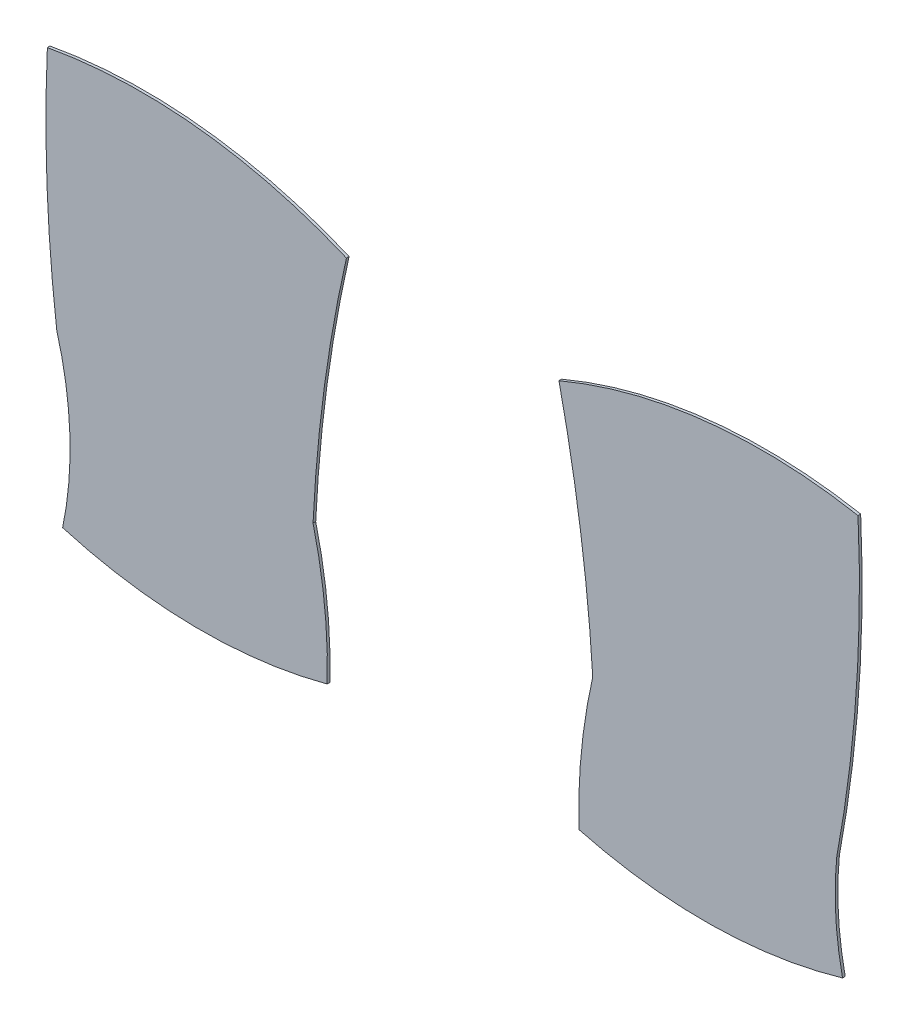
ISO-10303-21;
HEADER;
FILE_DESCRIPTION(('STEP AP214'),'2;1');
FILE_NAME('part.step','',(''),(''),'','','');
FILE_SCHEMA(('AUTOMOTIVE_DESIGN { 1 0 10303 214 1 1 1 1 }'));
ENDSEC;
DATA;
#1=APPLICATION_CONTEXT('core data for automotive mechanical design processes');
#2=APPLICATION_PROTOCOL_DEFINITION('international standard','automotive_design',2000,#1);
#3=PRODUCT_CONTEXT('',#1,'mechanical');
#4=PRODUCT('Part','Part','',(#3));
#5=PRODUCT_RELATED_PRODUCT_CATEGORY('part','',(#4));
#6=PRODUCT_DEFINITION_FORMATION('','',#4);
#7=PRODUCT_DEFINITION_CONTEXT('part definition',#1,'design');
#8=PRODUCT_DEFINITION('design','',#6,#7);
#9=PRODUCT_DEFINITION_SHAPE('','',#8);
#10=(LENGTH_UNIT() NAMED_UNIT(*) SI_UNIT(.MILLI.,.METRE.));
#11=(NAMED_UNIT(*) PLANE_ANGLE_UNIT() SI_UNIT($,.RADIAN.));
#12=(NAMED_UNIT(*) SI_UNIT($,.STERADIAN.) SOLID_ANGLE_UNIT());
#13=UNCERTAINTY_MEASURE_WITH_UNIT(LENGTH_MEASURE(1.E-05),#10,'distance_accuracy_value','');
#14=(GEOMETRIC_REPRESENTATION_CONTEXT(3) GLOBAL_UNCERTAINTY_ASSIGNED_CONTEXT((#13)) GLOBAL_UNIT_ASSIGNED_CONTEXT((#10,
#11,#12)) REPRESENTATION_CONTEXT('',''));
#15=CARTESIAN_POINT('',(0.,0.,0.));
#16=DIRECTION('',(0.,0.,1.));
#17=DIRECTION('',(1.,0.,0.));
#18=AXIS2_PLACEMENT_3D('',#15,#16,#17);
#19=CARTESIAN_POINT('',(80.1713590618614,25.8182537201133,0.1));
#20=DIRECTION('',(0.,0.,-1.));
#21=DIRECTION('',(-1.,0.,0.));
#22=AXIS2_PLACEMENT_3D('',#19,#20,#21);
#23=CYLINDRICAL_SURFACE('',#22,21.4266312052672);
#24=CARTESIAN_POINT('',(80.1713590618614,25.8182537201133,0.));
#25=DIRECTION('',(0.,0.,1.));
#26=DIRECTION('',(1.,0.,0.));
#27=AXIS2_PLACEMENT_3D('',#24,#25,#26);
#28=CIRCLE('',#27,21.4266312052672);
#29=CARTESIAN_POINT('',(59.2772554817541,30.5655645789343,0.));
#30=VERTEX_POINT('',#29);
#31=CARTESIAN_POINT('',(58.7503501447257,25.3274362606368,0.));
#32=VERTEX_POINT('',#31);
#33=EDGE_CURVE('E127',#30,#32,#28,.T.);
#34=ORIENTED_EDGE('',*,*,#33,.T.);
#35=DIRECTION('',(0.,0.,-1.));
#36=VECTOR('',#35,1.);
#37=CARTESIAN_POINT('',(58.7503501447257,25.3274362606368,0.1));
#38=LINE('',#37,#36);
#39=CARTESIAN_POINT('',(58.7503501447257,25.3274362606368,0.1));
#40=VERTEX_POINT('',#39);
#41=EDGE_CURVE('E12',#40,#32,#38,.T.);
#42=ORIENTED_EDGE('',*,*,#41,.F.);
#43=CARTESIAN_POINT('',(80.1713590618614,25.8182537201133,0.1));
#44=DIRECTION('',(0.,0.,1.));
#45=DIRECTION('',(1.,0.,0.));
#46=AXIS2_PLACEMENT_3D('',#43,#44,#45);
#47=CIRCLE('',#46,21.4266312052672);
#48=CARTESIAN_POINT('',(59.2772554817541,30.5655645789343,0.1));
#49=VERTEX_POINT('',#48);
#50=EDGE_CURVE('E137',#49,#40,#47,.T.);
#51=ORIENTED_EDGE('',*,*,#50,.F.);
#52=DIRECTION('',(0.,0.,-1.));
#53=VECTOR('',#52,1.);
#54=CARTESIAN_POINT('',(59.2772554817541,30.5655645789343,0.1));
#55=LINE('',#54,#53);
#56=EDGE_CURVE('E123',#49,#30,#55,.T.);
#57=ORIENTED_EDGE('',*,*,#56,.T.);
#58=EDGE_LOOP('',(#34,#42,#51,#57));
#59=FACE_BOUND('',#58,.T.);
#60=ADVANCED_FACE('F43',(#59),#23,.T.);
#61=CARTESIAN_POINT('',(63.5005492048398,43.2071904225175,0.1));
#62=DIRECTION('',(0.,0.,-1.));
#63=DIRECTION('',(-1.,0.,0.));
#64=AXIS2_PLACEMENT_3D('',#61,#62,#63);
#65=CYLINDRICAL_SURFACE('',#64,18.5);
#66=CARTESIAN_POINT('',(63.5005492048398,43.2071904225175,0.));
#67=DIRECTION('',(0.,0.,1.));
#68=DIRECTION('',(1.,0.,0.));
#69=AXIS2_PLACEMENT_3D('',#66,#67,#68);
#70=CIRCLE('',#69,18.5);
#71=CARTESIAN_POINT('',(68.6905961832509,25.4501238753119,0.));
#72=VERTEX_POINT('',#71);
#73=EDGE_CURVE('E130',#32,#72,#70,.T.);
#74=ORIENTED_EDGE('',*,*,#73,.T.);
#75=DIRECTION('',(0.,0.,-1.));
#76=VECTOR('',#75,1.);
#77=CARTESIAN_POINT('',(68.6905961832509,25.4501238753119,0.1));
#78=LINE('',#77,#76);
#79=CARTESIAN_POINT('',(68.6905961832509,25.4501238753119,0.1));
#80=VERTEX_POINT('',#79);
#81=EDGE_CURVE('E51',#80,#72,#78,.T.);
#82=ORIENTED_EDGE('',*,*,#81,.F.);
#83=CARTESIAN_POINT('',(63.5005492048398,43.2071904225175,0.1));
#84=DIRECTION('',(0.,0.,1.));
#85=DIRECTION('',(1.,0.,0.));
#86=AXIS2_PLACEMENT_3D('',#83,#84,#85);
#87=CIRCLE('',#86,18.5);
#88=EDGE_CURVE('E96',#40,#80,#87,.T.);
#89=ORIENTED_EDGE('',*,*,#88,.F.);
#90=ORIENTED_EDGE('',*,*,#41,.T.);
#91=EDGE_LOOP('',(#74,#82,#89,#90));
#92=FACE_BOUND('',#91,.T.);
#93=ADVANCED_FACE('F161',(#92),#65,.T.);
#94=CARTESIAN_POINT('',(80.8681917023297,28.075242465547,0.1));
#95=DIRECTION('',(0.,0.,-1.));
#96=DIRECTION('',(-1.,0.,0.));
#97=AXIS2_PLACEMENT_3D('',#94,#95,#96);
#98=CYLINDRICAL_SURFACE('',#97,12.4573303817104);
#99=CARTESIAN_POINT('',(80.8681917023297,28.075242465547,0.));
#100=DIRECTION('',(0.,0.,-1.));
#101=DIRECTION('',(1.,0.,0.));
#102=AXIS2_PLACEMENT_3D('',#99,#100,#101);
#103=CIRCLE('',#102,12.4573303817104);
#104=CARTESIAN_POINT('',(68.4699379891613,29.2870118755388,0.));
#105=VERTEX_POINT('',#104);
#106=EDGE_CURVE('E132',#72,#105,#103,.T.);
#107=ORIENTED_EDGE('',*,*,#106,.T.);
#108=DIRECTION('',(0.,0.,-1.));
#109=VECTOR('',#108,1.);
#110=CARTESIAN_POINT('',(68.4699379891613,29.2870118755388,0.1));
#111=LINE('',#110,#109);
#112=CARTESIAN_POINT('',(68.4699379891613,29.2870118755388,0.1));
#113=VERTEX_POINT('',#112);
#114=EDGE_CURVE('E118',#113,#105,#111,.T.);
#115=ORIENTED_EDGE('',*,*,#114,.F.);
#116=CARTESIAN_POINT('',(80.8681917023297,28.075242465547,0.1));
#117=DIRECTION('',(0.,0.,-1.));
#118=DIRECTION('',(1.,0.,0.));
#119=AXIS2_PLACEMENT_3D('',#116,#117,#118);
#120=CIRCLE('',#119,12.4573303817104);
#121=EDGE_CURVE('E109',#80,#113,#120,.T.);
#122=ORIENTED_EDGE('',*,*,#121,.F.);
#123=ORIENTED_EDGE('',*,*,#81,.T.);
#124=EDGE_LOOP('',(#107,#115,#122,#123));
#125=FACE_BOUND('',#124,.T.);
#126=ADVANCED_FACE('F143',(#125),#98,.F.);
#127=CARTESIAN_POINT('',(19.2590992236695,38.5085233662608,0.1));
#128=DIRECTION('',(0.,0.,-1.));
#129=DIRECTION('',(-1.,0.,0.));
#130=AXIS2_PLACEMENT_3D('',#127,#128,#129);
#131=CYLINDRICAL_SURFACE('',#130,50.0673838559271);
#132=CARTESIAN_POINT('',(19.2590992236695,38.5085233662608,0.));
#133=DIRECTION('',(0.,0.,1.));
#134=DIRECTION('',(1.,0.,0.));
#135=AXIS2_PLACEMENT_3D('',#132,#133,#134);
#136=CIRCLE('',#135,50.0673838559271);
#137=CARTESIAN_POINT('',(69.2724861008295,40.8331866219337,0.));
#138=VERTEX_POINT('',#137);
#139=EDGE_CURVE('E117',#105,#138,#136,.T.);
#140=ORIENTED_EDGE('',*,*,#139,.T.);
#141=DIRECTION('',(0.,0.,-1.));
#142=VECTOR('',#141,1.);
#143=CARTESIAN_POINT('',(69.2724861008295,40.8331866219337,0.1));
#144=LINE('',#143,#142);
#145=CARTESIAN_POINT('',(69.2724861008295,40.8331866219337,0.1));
#146=VERTEX_POINT('',#145);
#147=EDGE_CURVE('E114',#146,#138,#144,.T.);
#148=ORIENTED_EDGE('',*,*,#147,.F.);
#149=CARTESIAN_POINT('',(19.2590992236695,38.5085233662608,0.1));
#150=DIRECTION('',(0.,0.,1.));
#151=DIRECTION('',(1.,0.,0.));
#152=AXIS2_PLACEMENT_3D('',#149,#150,#151);
#153=CIRCLE('',#152,50.0673838559271);
#154=EDGE_CURVE('E103',#113,#146,#153,.T.);
#155=ORIENTED_EDGE('',*,*,#154,.F.);
#156=ORIENTED_EDGE('',*,*,#114,.T.);
#157=EDGE_LOOP('',(#140,#148,#155,#156));
#158=FACE_BOUND('',#157,.T.);
#159=ADVANCED_FACE('F115',(#158),#131,.T.);
#160=CARTESIAN_POINT('',(65.6990542636105,21.4078834047854,0.1));
#161=DIRECTION('',(0.,0.,-1.));
#162=DIRECTION('',(-1.,0.,0.));
#163=AXIS2_PLACEMENT_3D('',#160,#161,#162);
#164=CYLINDRICAL_SURFACE('',#163,19.7512485725182);
#165=CARTESIAN_POINT('',(65.6990542636105,21.4078834047854,0.));
#166=DIRECTION('',(0.,0.,1.));
#167=DIRECTION('',(1.,0.,0.));
#168=AXIS2_PLACEMENT_3D('',#165,#166,#167);
#169=CIRCLE('',#168,19.7512485725182);
#170=CARTESIAN_POINT('',(58.0038855326976,39.5984358531357,0.));
#171=VERTEX_POINT('',#170);
#172=EDGE_CURVE('E82',#138,#171,#169,.T.);
#173=ORIENTED_EDGE('',*,*,#172,.T.);
#174=DIRECTION('',(0.,0.,-1.));
#175=VECTOR('',#174,1.);
#176=CARTESIAN_POINT('',(58.0038855326976,39.5984358531357,0.1));
#177=LINE('',#176,#175);
#178=CARTESIAN_POINT('',(58.0038855326976,39.5984358531357,0.1));
#179=VERTEX_POINT('',#178);
#180=EDGE_CURVE('E119',#179,#171,#177,.T.);
#181=ORIENTED_EDGE('',*,*,#180,.F.);
#182=CARTESIAN_POINT('',(65.6990542636105,21.4078834047854,0.1));
#183=DIRECTION('',(0.,0.,1.));
#184=DIRECTION('',(1.,0.,0.));
#185=AXIS2_PLACEMENT_3D('',#182,#183,#184);
#186=CIRCLE('',#185,19.7512485725182);
#187=EDGE_CURVE('E107',#146,#179,#186,.T.);
#188=ORIENTED_EDGE('',*,*,#187,.F.);
#189=ORIENTED_EDGE('',*,*,#147,.T.);
#190=EDGE_LOOP('',(#173,#181,#188,#189));
#191=FACE_BOUND('',#190,.T.);
#192=ADVANCED_FACE('F121',(#191),#164,.T.);
#193=CARTESIAN_POINT('',(1.07888147989161,26.9674901339877,0.1));
#194=DIRECTION('',(0.,0.,-1.));
#195=DIRECTION('',(-1.,0.,0.));
#196=AXIS2_PLACEMENT_3D('',#193,#194,#195);
#197=CYLINDRICAL_SURFACE('',#196,58.3094921618431);
#198=CARTESIAN_POINT('',(1.07888147989161,26.9674901339877,0.));
#199=DIRECTION('',(0.,0.,-1.));
#200=DIRECTION('',(1.,0.,0.));
#201=AXIS2_PLACEMENT_3D('',#198,#199,#200);
#202=CIRCLE('',#201,58.3094921618431);
#203=EDGE_CURVE('E88',#171,#30,#202,.T.);
#204=ORIENTED_EDGE('',*,*,#203,.T.);
#205=ORIENTED_EDGE('',*,*,#56,.F.);
#206=CARTESIAN_POINT('',(1.07888147989161,26.9674901339877,0.1));
#207=DIRECTION('',(0.,0.,-1.));
#208=DIRECTION('',(1.,0.,0.));
#209=AXIS2_PLACEMENT_3D('',#206,#207,#208);
#210=CIRCLE('',#209,58.3094921618431);
#211=EDGE_CURVE('E59',#179,#49,#210,.T.);
#212=ORIENTED_EDGE('',*,*,#211,.F.);
#213=ORIENTED_EDGE('',*,*,#180,.T.);
#214=EDGE_LOOP('',(#204,#205,#212,#213));
#215=FACE_BOUND('',#214,.T.);
#216=ADVANCED_FACE('F150',(#215),#197,.F.);
#217=CARTESIAN_POINT('',(71.8359541333506,34.5127220713154,0.1));
#218=DIRECTION('',(0.,0.,1.));
#219=DIRECTION('',(1.,0.,0.));
#220=AXIS2_PLACEMENT_3D('',#217,#218,#219);
#221=PLANE('',#220);
#222=ORIENTED_EDGE('',*,*,#50,.T.);
#223=ORIENTED_EDGE('',*,*,#88,.T.);
#224=ORIENTED_EDGE('',*,*,#121,.T.);
#225=ORIENTED_EDGE('',*,*,#154,.T.);
#226=ORIENTED_EDGE('',*,*,#187,.T.);
#227=ORIENTED_EDGE('',*,*,#211,.T.);
#228=EDGE_LOOP('',(#222,#223,#224,#225,#226,#227));
#229=FACE_BOUND('',#228,.T.);
#230=ADVANCED_FACE('F105',(#229),#221,.T.);
#231=CARTESIAN_POINT('',(71.8359541333506,34.5127220713154,0.));
#232=DIRECTION('',(0.,0.,1.));
#233=DIRECTION('',(1.,0.,0.));
#234=AXIS2_PLACEMENT_3D('',#231,#232,#233);
#235=PLANE('',#234);
#236=ORIENTED_EDGE('',*,*,#33,.F.);
#237=ORIENTED_EDGE('',*,*,#203,.F.);
#238=ORIENTED_EDGE('',*,*,#172,.F.);
#239=ORIENTED_EDGE('',*,*,#139,.F.);
#240=ORIENTED_EDGE('',*,*,#106,.F.);
#241=ORIENTED_EDGE('',*,*,#73,.F.);
#242=EDGE_LOOP('',(#236,#237,#238,#239,#240,#241));
#243=FACE_BOUND('',#242,.T.);
#244=ADVANCED_FACE('F146',(#243),#235,.F.);
#245=CLOSED_SHELL('',(#60,#93,#126,#159,#192,#216,#230,#244));
#246=MANIFOLD_SOLID_BREP('B2',#245);
#247=CARTESIAN_POINT('',(42.3039163774709,21.4061715295941,0.1));
#248=DIRECTION('',(0.,0.,-1.));
#249=DIRECTION('',(-1.,0.,0.));
#250=AXIS2_PLACEMENT_3D('',#247,#248,#249);
#251=CYLINDRICAL_SURFACE('',#250,19.7512485725184);
#252=CARTESIAN_POINT('',(42.3039163774709,21.4061715295941,0.));
#253=DIRECTION('',(0.,0.,1.));
#254=DIRECTION('',(1.,0.,0.));
#255=AXIS2_PLACEMENT_3D('',#252,#253,#254);
#256=CIRCLE('',#255,19.7512485725184);
#257=CARTESIAN_POINT('',(49.9964229381992,39.5978499289767,0.));
#258=VERTEX_POINT('',#257);
#259=CARTESIAN_POINT('',(38.7276417917189,40.8309515865398,0.));
#260=VERTEX_POINT('',#259);
#261=EDGE_CURVE('E303',#258,#260,#256,.T.);
#262=ORIENTED_EDGE('',*,*,#261,.T.);
#263=DIRECTION('',(0.,0.,-1.));
#264=VECTOR('',#263,1.);
#265=CARTESIAN_POINT('',(38.7276417917189,40.8309515865398,0.1));
#266=LINE('',#265,#264);
#267=CARTESIAN_POINT('',(38.7276417917189,40.8309515865398,0.1));
#268=VERTEX_POINT('',#267);
#269=EDGE_CURVE('E41',#268,#260,#266,.T.);
#270=ORIENTED_EDGE('',*,*,#269,.F.);
#271=CARTESIAN_POINT('',(42.3039163774709,21.4061715295941,0.1));
#272=DIRECTION('',(0.,0.,1.));
#273=DIRECTION('',(1.,0.,0.));
#274=AXIS2_PLACEMENT_3D('',#271,#272,#273);
#275=CIRCLE('',#274,19.7512485725184);
#276=CARTESIAN_POINT('',(49.9964229381992,39.5978499289767,0.1));
#277=VERTEX_POINT('',#276);
#278=EDGE_CURVE('E313',#277,#268,#275,.T.);
#279=ORIENTED_EDGE('',*,*,#278,.F.);
#280=DIRECTION('',(0.,0.,-1.));
#281=VECTOR('',#280,1.);
#282=CARTESIAN_POINT('',(49.9964229381992,39.5978499289767,0.1));
#283=LINE('',#282,#281);
#284=EDGE_CURVE('E299',#277,#258,#283,.T.);
#285=ORIENTED_EDGE('',*,*,#284,.T.);
#286=EDGE_LOOP('',(#262,#270,#279,#285));
#287=FACE_BOUND('',#286,.T.);
#288=ADVANCED_FACE('F219',(#287),#251,.T.);
#289=CARTESIAN_POINT('',(92.82258310813,38.416542757243,0.1));
#290=DIRECTION('',(0.,0.,-1.));
#291=DIRECTION('',(-1.,0.,0.));
#292=AXIS2_PLACEMENT_3D('',#289,#290,#291);
#293=CYLINDRICAL_SURFACE('',#292,54.1487954253919);
#294=CARTESIAN_POINT('',(92.82258310813,38.416542757243,0.));
#295=DIRECTION('',(0.,0.,1.));
#296=DIRECTION('',(1.,0.,0.));
#297=AXIS2_PLACEMENT_3D('',#294,#295,#296);
#298=CIRCLE('',#297,54.1487954253919);
#299=CARTESIAN_POINT('',(39.0826398987247,31.7749653940834,0.));
#300=VERTEX_POINT('',#299);
#301=EDGE_CURVE('E306',#260,#300,#298,.T.);
#302=ORIENTED_EDGE('',*,*,#301,.T.);
#303=DIRECTION('',(0.,0.,-1.));
#304=VECTOR('',#303,1.);
#305=CARTESIAN_POINT('',(39.0826398987247,31.7749653940834,0.1));
#306=LINE('',#305,#304);
#307=CARTESIAN_POINT('',(39.0826398987247,31.7749653940834,0.1));
#308=VERTEX_POINT('',#307);
#309=EDGE_CURVE('E227',#308,#300,#306,.T.);
#310=ORIENTED_EDGE('',*,*,#309,.F.);
#311=CARTESIAN_POINT('',(92.82258310813,38.416542757243,0.1));
#312=DIRECTION('',(0.,0.,1.));
#313=DIRECTION('',(1.,0.,0.));
#314=AXIS2_PLACEMENT_3D('',#311,#312,#313);
#315=CIRCLE('',#314,54.1487954253919);
#316=EDGE_CURVE('E272',#268,#308,#315,.T.);
#317=ORIENTED_EDGE('',*,*,#316,.F.);
#318=ORIENTED_EDGE('',*,*,#269,.T.);
#319=EDGE_LOOP('',(#302,#310,#317,#318));
#320=FACE_BOUND('',#319,.T.);
#321=ADVANCED_FACE('F337',(#320),#293,.T.);
#322=CARTESIAN_POINT('',(26.3398142352757,28.1634533149341,0.1));
#323=DIRECTION('',(0.,0.,-1.));
#324=DIRECTION('',(-1.,0.,0.));
#325=AXIS2_PLACEMENT_3D('',#322,#323,#324);
#326=CYLINDRICAL_SURFACE('',#325,13.2447206609613);
#327=CARTESIAN_POINT('',(26.3398142352757,28.1634533149341,0.));
#328=DIRECTION('',(0.,0.,-1.));
#329=DIRECTION('',(1.,0.,0.));
#330=AXIS2_PLACEMENT_3D('',#327,#328,#329);
#331=CIRCLE('',#330,13.2447206609613);
#332=CARTESIAN_POINT('',(39.3038794032982,25.451325053557,0.));
#333=VERTEX_POINT('',#332);
#334=EDGE_CURVE('E308',#300,#333,#331,.T.);
#335=ORIENTED_EDGE('',*,*,#334,.T.);
#336=DIRECTION('',(0.,0.,-1.));
#337=VECTOR('',#336,1.);
#338=CARTESIAN_POINT('',(39.3038794032982,25.451325053557,0.1));
#339=LINE('',#338,#337);
#340=CARTESIAN_POINT('',(39.3038794032982,25.451325053557,0.1));
#341=VERTEX_POINT('',#340);
#342=EDGE_CURVE('E294',#341,#333,#339,.T.);
#343=ORIENTED_EDGE('',*,*,#342,.F.);
#344=CARTESIAN_POINT('',(26.3398142352757,28.1634533149341,0.1));
#345=DIRECTION('',(0.,0.,-1.));
#346=DIRECTION('',(1.,0.,0.));
#347=AXIS2_PLACEMENT_3D('',#344,#345,#346);
#348=CIRCLE('',#347,13.2447206609613);
#349=EDGE_CURVE('E285',#308,#341,#348,.T.);
#350=ORIENTED_EDGE('',*,*,#349,.F.);
#351=ORIENTED_EDGE('',*,*,#309,.T.);
#352=EDGE_LOOP('',(#335,#343,#350,#351));
#353=FACE_BOUND('',#352,.T.);
#354=ADVANCED_FACE('F319',(#353),#326,.F.);
#355=CARTESIAN_POINT('',(44.4980342911842,43.2071904225174,0.1));
#356=DIRECTION('',(0.,0.,-1.));
#357=DIRECTION('',(-1.,0.,0.));
#358=AXIS2_PLACEMENT_3D('',#355,#356,#357);
#359=CYLINDRICAL_SURFACE('',#358,18.4999999999999);
#360=CARTESIAN_POINT('',(44.4980342911842,43.2071904225174,0.));
#361=DIRECTION('',(0.,0.,1.));
#362=DIRECTION('',(1.,0.,0.));
#363=AXIS2_PLACEMENT_3D('',#360,#361,#362);
#364=CIRCLE('',#363,18.4999999999999);
#365=CARTESIAN_POINT('',(49.2719204088619,25.3337461171956,0.));
#366=VERTEX_POINT('',#365);
#367=EDGE_CURVE('E293',#333,#366,#364,.T.);
#368=ORIENTED_EDGE('',*,*,#367,.T.);
#369=DIRECTION('',(0.,0.,-1.));
#370=VECTOR('',#369,1.);
#371=CARTESIAN_POINT('',(49.2719204088619,25.3337461171956,0.1));
#372=LINE('',#371,#370);
#373=CARTESIAN_POINT('',(49.2719204088619,25.3337461171956,0.1));
#374=VERTEX_POINT('',#373);
#375=EDGE_CURVE('E290',#374,#366,#372,.T.);
#376=ORIENTED_EDGE('',*,*,#375,.F.);
#377=CARTESIAN_POINT('',(44.4980342911842,43.2071904225174,0.1));
#378=DIRECTION('',(0.,0.,1.));
#379=DIRECTION('',(1.,0.,0.));
#380=AXIS2_PLACEMENT_3D('',#377,#378,#379);
#381=CIRCLE('',#380,18.4999999999999);
#382=EDGE_CURVE('E279',#341,#374,#381,.T.);
#383=ORIENTED_EDGE('',*,*,#382,.F.);
#384=ORIENTED_EDGE('',*,*,#342,.T.);
#385=EDGE_LOOP('',(#368,#376,#383,#384));
#386=FACE_BOUND('',#385,.T.);
#387=ADVANCED_FACE('F291',(#386),#359,.T.);
#388=CARTESIAN_POINT('',(30.7585391673039,25.8735926421761,0.1));
#389=DIRECTION('',(0.,0.,-1.));
#390=DIRECTION('',(-1.,0.,0.));
#391=AXIS2_PLACEMENT_3D('',#388,#389,#390);
#392=CYLINDRICAL_SURFACE('',#391,18.5212504779188);
#393=CARTESIAN_POINT('',(30.7585391673039,25.8735926421761,0.));
#394=DIRECTION('',(0.,0.,1.));
#395=DIRECTION('',(1.,0.,0.));
#396=AXIS2_PLACEMENT_3D('',#393,#394,#395);
#397=CIRCLE('',#396,18.5212504779188);
#398=CARTESIAN_POINT('',(48.7388028875999,30.3173338378821,0.));
#399=VERTEX_POINT('',#398);
#400=EDGE_CURVE('E258',#366,#399,#397,.T.);
#401=ORIENTED_EDGE('',*,*,#400,.T.);
#402=DIRECTION('',(0.,0.,-1.));
#403=VECTOR('',#402,1.);
#404=CARTESIAN_POINT('',(48.7388028875999,30.3173338378821,0.1));
#405=LINE('',#404,#403);
#406=CARTESIAN_POINT('',(48.7388028875999,30.3173338378821,0.1));
#407=VERTEX_POINT('',#406);
#408=EDGE_CURVE('E295',#407,#399,#405,.T.);
#409=ORIENTED_EDGE('',*,*,#408,.F.);
#410=CARTESIAN_POINT('',(30.7585391673039,25.8735926421761,0.1));
#411=DIRECTION('',(0.,0.,1.));
#412=DIRECTION('',(1.,0.,0.));
#413=AXIS2_PLACEMENT_3D('',#410,#411,#412);
#414=CIRCLE('',#413,18.5212504779188);
#415=EDGE_CURVE('E283',#374,#407,#414,.T.);
#416=ORIENTED_EDGE('',*,*,#415,.F.);
#417=ORIENTED_EDGE('',*,*,#375,.T.);
#418=EDGE_LOOP('',(#401,#409,#416,#417));
#419=FACE_BOUND('',#418,.T.);
#420=ADVANCED_FACE('F297',(#419),#392,.T.);
#421=CARTESIAN_POINT('',(102.146760029671,27.8053911851005,0.1));
#422=DIRECTION('',(0.,0.,-1.));
#423=DIRECTION('',(-1.,0.,0.));
#424=AXIS2_PLACEMENT_3D('',#421,#422,#423);
#425=CYLINDRICAL_SURFACE('',#424,53.466996754822);
#426=CARTESIAN_POINT('',(102.146760029671,27.8053911851005,0.));
#427=DIRECTION('',(0.,0.,-1.));
#428=DIRECTION('',(1.,0.,0.));
#429=AXIS2_PLACEMENT_3D('',#426,#427,#428);
#430=CIRCLE('',#429,53.466996754822);
#431=EDGE_CURVE('E264',#399,#258,#430,.T.);
#432=ORIENTED_EDGE('',*,*,#431,.T.);
#433=ORIENTED_EDGE('',*,*,#284,.F.);
#434=CARTESIAN_POINT('',(102.146760029671,27.8053911851005,0.1));
#435=DIRECTION('',(0.,0.,-1.));
#436=DIRECTION('',(1.,0.,0.));
#437=AXIS2_PLACEMENT_3D('',#434,#435,#436);
#438=CIRCLE('',#437,53.466996754822);
#439=EDGE_CURVE('E235',#407,#277,#438,.T.);
#440=ORIENTED_EDGE('',*,*,#439,.F.);
#441=ORIENTED_EDGE('',*,*,#408,.T.);
#442=EDGE_LOOP('',(#432,#433,#440,#441));
#443=FACE_BOUND('',#442,.T.);
#444=ADVANCED_FACE('F326',(#443),#425,.F.);
#445=CARTESIAN_POINT('',(67.5632497428005,29.9113571434186,0.1));
#446=DIRECTION('',(0.,0.,1.));
#447=DIRECTION('',(1.,0.,0.));
#448=AXIS2_PLACEMENT_3D('',#445,#446,#447);
#449=PLANE('',#448);
#450=ORIENTED_EDGE('',*,*,#278,.T.);
#451=ORIENTED_EDGE('',*,*,#316,.T.);
#452=ORIENTED_EDGE('',*,*,#349,.T.);
#453=ORIENTED_EDGE('',*,*,#382,.T.);
#454=ORIENTED_EDGE('',*,*,#415,.T.);
#455=ORIENTED_EDGE('',*,*,#439,.T.);
#456=EDGE_LOOP('',(#450,#451,#452,#453,#454,#455));
#457=FACE_BOUND('',#456,.T.);
#458=ADVANCED_FACE('F281',(#457),#449,.T.);
#459=CARTESIAN_POINT('',(67.5632497428005,29.9113571434186,0.));
#460=DIRECTION('',(0.,0.,1.));
#461=DIRECTION('',(1.,0.,0.));
#462=AXIS2_PLACEMENT_3D('',#459,#460,#461);
#463=PLANE('',#462);
#464=ORIENTED_EDGE('',*,*,#261,.F.);
#465=ORIENTED_EDGE('',*,*,#431,.F.);
#466=ORIENTED_EDGE('',*,*,#400,.F.);
#467=ORIENTED_EDGE('',*,*,#367,.F.);
#468=ORIENTED_EDGE('',*,*,#334,.F.);
#469=ORIENTED_EDGE('',*,*,#301,.F.);
#470=EDGE_LOOP('',(#464,#465,#466,#467,#468,#469));
#471=FACE_BOUND('',#470,.T.);
#472=ADVANCED_FACE('F322',(#471),#463,.F.);
#473=CLOSED_SHELL('',(#288,#321,#354,#387,#420,#444,#458,#472));
#474=MANIFOLD_SOLID_BREP('B6',#473);
#475=ADVANCED_BREP_SHAPE_REPRESENTATION('',(#18,#246,#474),#14);
#476=SHAPE_DEFINITION_REPRESENTATION(#9,#475);
ENDSEC;
END-ISO-10303-21;
